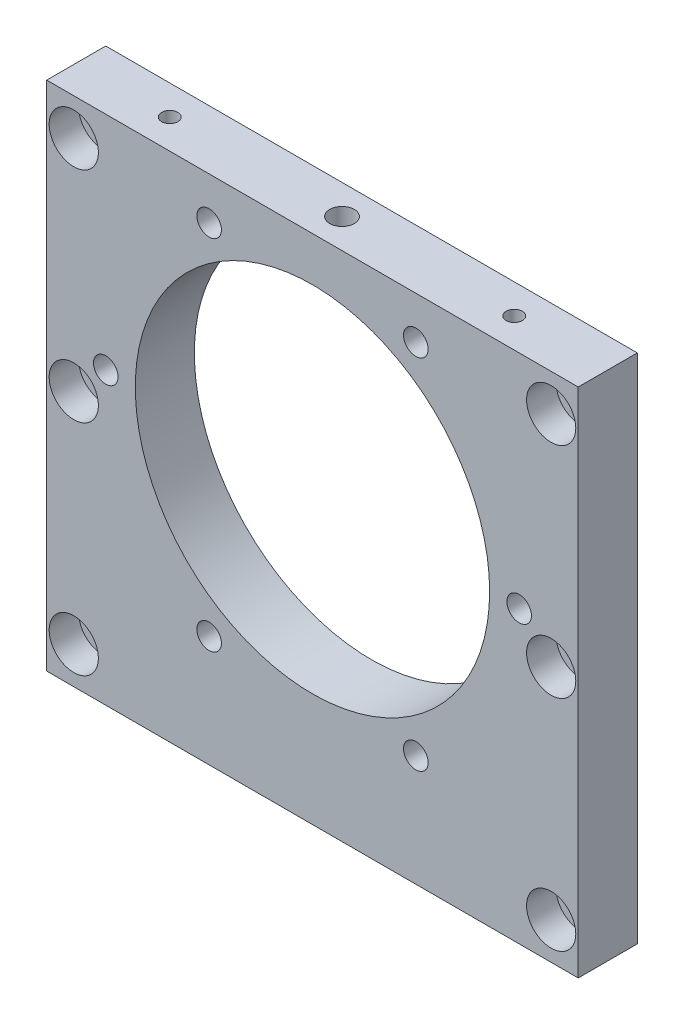
ISO-10303-21;
HEADER;
FILE_DESCRIPTION(('STEP AP214'),'2;1');
FILE_NAME('part.step','',(''),(''),'','','');
FILE_SCHEMA(('AUTOMOTIVE_DESIGN { 1 0 10303 214 1 1 1 1 }'));
ENDSEC;
DATA;
#1=APPLICATION_CONTEXT('core data for automotive mechanical design processes');
#2=APPLICATION_PROTOCOL_DEFINITION('international standard','automotive_design',2000,#1);
#3=PRODUCT_CONTEXT('',#1,'mechanical');
#4=PRODUCT('Part','Part','',(#3));
#5=PRODUCT_RELATED_PRODUCT_CATEGORY('part','',(#4));
#6=PRODUCT_DEFINITION_FORMATION('','',#4);
#7=PRODUCT_DEFINITION_CONTEXT('part definition',#1,'design');
#8=PRODUCT_DEFINITION('design','',#6,#7);
#9=PRODUCT_DEFINITION_SHAPE('','',#8);
#10=(LENGTH_UNIT() NAMED_UNIT(*) SI_UNIT(.MILLI.,.METRE.));
#11=(NAMED_UNIT(*) PLANE_ANGLE_UNIT() SI_UNIT($,.RADIAN.));
#12=(NAMED_UNIT(*) SI_UNIT($,.STERADIAN.) SOLID_ANGLE_UNIT());
#13=UNCERTAINTY_MEASURE_WITH_UNIT(LENGTH_MEASURE(1.E-05),#10,'distance_accuracy_value','');
#14=(GEOMETRIC_REPRESENTATION_CONTEXT(3) GLOBAL_UNCERTAINTY_ASSIGNED_CONTEXT((#13)) GLOBAL_UNIT_ASSIGNED_CONTEXT((#10,
#11,#12)) REPRESENTATION_CONTEXT('',''));
#15=CARTESIAN_POINT('',(0.,0.,0.));
#16=DIRECTION('',(0.,0.,1.));
#17=DIRECTION('',(1.,0.,0.));
#18=AXIS2_PLACEMENT_3D('',#15,#16,#17);
#19=CARTESIAN_POINT('',(48.5,44.5,6.));
#20=DIRECTION('',(0.,0.,-1.));
#21=DIRECTION('',(-1.,0.,0.));
#22=AXIS2_PLACEMENT_3D('',#19,#20,#21);
#23=CYLINDRICAL_SURFACE('',#22,3.25);
#24=CARTESIAN_POINT('',(48.5,44.5,-6.));
#25=DIRECTION('',(0.,0.,1.));
#26=DIRECTION('',(-1.,0.,0.));
#27=AXIS2_PLACEMENT_3D('',#24,#25,#26);
#28=CIRCLE('',#27,3.25);
#29=CARTESIAN_POINT('',(45.25,44.5,-6.));
#30=VERTEX_POINT('',#29);
#31=EDGE_CURVE('E200',#30,#30,#28,.T.);
#32=ORIENTED_EDGE('',*,*,#31,.F.);
#33=EDGE_LOOP('',(#32));
#34=FACE_BOUND('',#33,.T.);
#35=CARTESIAN_POINT('',(48.5,44.5,0.));
#36=DIRECTION('',(0.,0.,1.));
#37=DIRECTION('',(1.,0.,0.));
#38=AXIS2_PLACEMENT_3D('',#35,#36,#37);
#39=CIRCLE('',#38,3.25);
#40=CARTESIAN_POINT('',(51.75,44.5,0.));
#41=VERTEX_POINT('',#40);
#42=EDGE_CURVE('E125',#41,#41,#39,.T.);
#43=ORIENTED_EDGE('',*,*,#42,.T.);
#44=EDGE_LOOP('',(#43));
#45=FACE_BOUND('',#44,.T.);
#46=ADVANCED_FACE('F36',(#34,#45),#23,.F.);
#47=CARTESIAN_POINT('',(48.5,0.,6.));
#48=DIRECTION('',(0.,0.,-1.));
#49=DIRECTION('',(-1.,0.,0.));
#50=AXIS2_PLACEMENT_3D('',#47,#48,#49);
#51=CYLINDRICAL_SURFACE('',#50,3.25);
#52=CARTESIAN_POINT('',(48.5,0.,-6.));
#53=DIRECTION('',(0.,0.,1.));
#54=DIRECTION('',(-1.,0.,0.));
#55=AXIS2_PLACEMENT_3D('',#52,#53,#54);
#56=CIRCLE('',#55,3.25);
#57=CARTESIAN_POINT('',(45.25,0.,-6.));
#58=VERTEX_POINT('',#57);
#59=EDGE_CURVE('E203',#58,#58,#56,.T.);
#60=ORIENTED_EDGE('',*,*,#59,.F.);
#61=EDGE_LOOP('',(#60));
#62=FACE_BOUND('',#61,.T.);
#63=CARTESIAN_POINT('',(48.5,0.,0.));
#64=DIRECTION('',(0.,0.,1.));
#65=DIRECTION('',(1.,0.,0.));
#66=AXIS2_PLACEMENT_3D('',#63,#64,#65);
#67=CIRCLE('',#66,3.25);
#68=CARTESIAN_POINT('',(51.75,0.,0.));
#69=VERTEX_POINT('',#68);
#70=EDGE_CURVE('E132',#69,#69,#67,.T.);
#71=ORIENTED_EDGE('',*,*,#70,.T.);
#72=EDGE_LOOP('',(#71));
#73=FACE_BOUND('',#72,.T.);
#74=ADVANCED_FACE('F320',(#62,#73),#51,.F.);
#75=CARTESIAN_POINT('',(48.5,-44.5,6.));
#76=DIRECTION('',(0.,0.,-1.));
#77=DIRECTION('',(-1.,0.,0.));
#78=AXIS2_PLACEMENT_3D('',#75,#76,#77);
#79=CYLINDRICAL_SURFACE('',#78,3.25);
#80=CARTESIAN_POINT('',(48.5,-44.5,-6.));
#81=DIRECTION('',(0.,0.,1.));
#82=DIRECTION('',(-1.,0.,0.));
#83=AXIS2_PLACEMENT_3D('',#80,#81,#82);
#84=CIRCLE('',#83,3.25);
#85=CARTESIAN_POINT('',(45.25,-44.5,-6.));
#86=VERTEX_POINT('',#85);
#87=EDGE_CURVE('E206',#86,#86,#84,.T.);
#88=ORIENTED_EDGE('',*,*,#87,.F.);
#89=EDGE_LOOP('',(#88));
#90=FACE_BOUND('',#89,.T.);
#91=CARTESIAN_POINT('',(48.5,-44.5,0.));
#92=DIRECTION('',(0.,0.,1.));
#93=DIRECTION('',(1.,0.,0.));
#94=AXIS2_PLACEMENT_3D('',#91,#92,#93);
#95=CIRCLE('',#94,3.25);
#96=CARTESIAN_POINT('',(51.75,-44.5,0.));
#97=VERTEX_POINT('',#96);
#98=EDGE_CURVE('E139',#97,#97,#95,.T.);
#99=ORIENTED_EDGE('',*,*,#98,.T.);
#100=EDGE_LOOP('',(#99));
#101=FACE_BOUND('',#100,.T.);
#102=ADVANCED_FACE('F325',(#90,#101),#79,.F.);
#103=CARTESIAN_POINT('',(-48.5,-44.5,6.));
#104=DIRECTION('',(0.,0.,-1.));
#105=DIRECTION('',(-1.,0.,0.));
#106=AXIS2_PLACEMENT_3D('',#103,#104,#105);
#107=CYLINDRICAL_SURFACE('',#106,3.25);
#108=CARTESIAN_POINT('',(-48.5,-44.5,-6.));
#109=DIRECTION('',(0.,0.,1.));
#110=DIRECTION('',(1.,0.,0.));
#111=AXIS2_PLACEMENT_3D('',#108,#109,#110);
#112=CIRCLE('',#111,3.25);
#113=CARTESIAN_POINT('',(-45.25,-44.5,-6.));
#114=VERTEX_POINT('',#113);
#115=EDGE_CURVE('E209',#114,#114,#112,.T.);
#116=ORIENTED_EDGE('',*,*,#115,.F.);
#117=EDGE_LOOP('',(#116));
#118=FACE_BOUND('',#117,.T.);
#119=CARTESIAN_POINT('',(-48.5,-44.5,0.));
#120=DIRECTION('',(0.,0.,1.));
#121=DIRECTION('',(1.,0.,0.));
#122=AXIS2_PLACEMENT_3D('',#119,#120,#121);
#123=CIRCLE('',#122,3.25);
#124=CARTESIAN_POINT('',(-45.25,-44.5,0.));
#125=VERTEX_POINT('',#124);
#126=EDGE_CURVE('E146',#125,#125,#123,.T.);
#127=ORIENTED_EDGE('',*,*,#126,.T.);
#128=EDGE_LOOP('',(#127));
#129=FACE_BOUND('',#128,.T.);
#130=ADVANCED_FACE('F333',(#118,#129),#107,.F.);
#131=CARTESIAN_POINT('',(-48.5,0.,6.));
#132=DIRECTION('',(0.,0.,-1.));
#133=DIRECTION('',(-1.,0.,0.));
#134=AXIS2_PLACEMENT_3D('',#131,#132,#133);
#135=CYLINDRICAL_SURFACE('',#134,3.25);
#136=CARTESIAN_POINT('',(-48.5,0.,-6.));
#137=DIRECTION('',(0.,0.,1.));
#138=DIRECTION('',(1.,0.,0.));
#139=AXIS2_PLACEMENT_3D('',#136,#137,#138);
#140=CIRCLE('',#139,3.25);
#141=CARTESIAN_POINT('',(-45.25,0.,-6.));
#142=VERTEX_POINT('',#141);
#143=EDGE_CURVE('E212',#142,#142,#140,.T.);
#144=ORIENTED_EDGE('',*,*,#143,.F.);
#145=EDGE_LOOP('',(#144));
#146=FACE_BOUND('',#145,.T.);
#147=CARTESIAN_POINT('',(-48.5,0.,0.));
#148=DIRECTION('',(0.,0.,1.));
#149=DIRECTION('',(1.,0.,0.));
#150=AXIS2_PLACEMENT_3D('',#147,#148,#149);
#151=CIRCLE('',#150,3.25);
#152=CARTESIAN_POINT('',(-45.25,0.,0.));
#153=VERTEX_POINT('',#152);
#154=EDGE_CURVE('E153',#153,#153,#151,.T.);
#155=ORIENTED_EDGE('',*,*,#154,.T.);
#156=EDGE_LOOP('',(#155));
#157=FACE_BOUND('',#156,.T.);
#158=ADVANCED_FACE('F337',(#146,#157),#135,.F.);
#159=CARTESIAN_POINT('',(-48.5,44.5,6.));
#160=DIRECTION('',(0.,0.,-1.));
#161=DIRECTION('',(-1.,0.,0.));
#162=AXIS2_PLACEMENT_3D('',#159,#160,#161);
#163=CYLINDRICAL_SURFACE('',#162,3.25);
#164=CARTESIAN_POINT('',(-48.5,44.5,-6.));
#165=DIRECTION('',(0.,0.,1.));
#166=DIRECTION('',(1.,0.,0.));
#167=AXIS2_PLACEMENT_3D('',#164,#165,#166);
#168=CIRCLE('',#167,3.25);
#169=CARTESIAN_POINT('',(-45.25,44.5,-6.));
#170=VERTEX_POINT('',#169);
#171=EDGE_CURVE('E215',#170,#170,#168,.T.);
#172=ORIENTED_EDGE('',*,*,#171,.F.);
#173=EDGE_LOOP('',(#172));
#174=FACE_BOUND('',#173,.T.);
#175=CARTESIAN_POINT('',(-48.5,44.5,0.));
#176=DIRECTION('',(0.,0.,1.));
#177=DIRECTION('',(1.,0.,0.));
#178=AXIS2_PLACEMENT_3D('',#175,#176,#177);
#179=CIRCLE('',#178,3.25);
#180=CARTESIAN_POINT('',(-45.25,44.5,0.));
#181=VERTEX_POINT('',#180);
#182=EDGE_CURVE('E160',#181,#181,#179,.T.);
#183=ORIENTED_EDGE('',*,*,#182,.T.);
#184=EDGE_LOOP('',(#183));
#185=FACE_BOUND('',#184,.T.);
#186=ADVANCED_FACE('F273',(#174,#185),#163,.F.);
#187=CARTESIAN_POINT('',(-54.,52.,6.));
#188=DIRECTION('',(0.,0.,1.));
#189=DIRECTION('',(1.,0.,0.));
#190=AXIS2_PLACEMENT_3D('',#187,#188,#189);
#191=PLANE('',#190);
#192=CARTESIAN_POINT('',(48.5,44.5,6.));
#193=DIRECTION('',(0.,0.,1.));
#194=DIRECTION('',(1.,0.,0.));
#195=AXIS2_PLACEMENT_3D('',#192,#193,#194);
#196=CIRCLE('',#195,5.);
#197=CARTESIAN_POINT('',(53.5,44.5,6.));
#198=VERTEX_POINT('',#197);
#199=EDGE_CURVE('E126',#198,#198,#196,.T.);
#200=ORIENTED_EDGE('',*,*,#199,.F.);
#201=EDGE_LOOP('',(#200));
#202=FACE_BOUND('',#201,.T.);
#203=CARTESIAN_POINT('',(48.5,0.,6.));
#204=DIRECTION('',(0.,0.,1.));
#205=DIRECTION('',(1.,0.,0.));
#206=AXIS2_PLACEMENT_3D('',#203,#204,#205);
#207=CIRCLE('',#206,5.);
#208=CARTESIAN_POINT('',(53.5,0.,6.));
#209=VERTEX_POINT('',#208);
#210=EDGE_CURVE('E133',#209,#209,#207,.T.);
#211=ORIENTED_EDGE('',*,*,#210,.F.);
#212=EDGE_LOOP('',(#211));
#213=FACE_BOUND('',#212,.T.);
#214=CARTESIAN_POINT('',(48.5,-44.5,6.));
#215=DIRECTION('',(0.,0.,1.));
#216=DIRECTION('',(1.,0.,0.));
#217=AXIS2_PLACEMENT_3D('',#214,#215,#216);
#218=CIRCLE('',#217,5.);
#219=CARTESIAN_POINT('',(53.5,-44.5,6.));
#220=VERTEX_POINT('',#219);
#221=EDGE_CURVE('E140',#220,#220,#218,.T.);
#222=ORIENTED_EDGE('',*,*,#221,.F.);
#223=EDGE_LOOP('',(#222));
#224=FACE_BOUND('',#223,.T.);
#225=CARTESIAN_POINT('',(-48.5,-44.5,6.));
#226=DIRECTION('',(0.,0.,1.));
#227=DIRECTION('',(1.,0.,0.));
#228=AXIS2_PLACEMENT_3D('',#225,#226,#227);
#229=CIRCLE('',#228,5.);
#230=CARTESIAN_POINT('',(-43.5,-44.5,6.));
#231=VERTEX_POINT('',#230);
#232=EDGE_CURVE('E147',#231,#231,#229,.T.);
#233=ORIENTED_EDGE('',*,*,#232,.F.);
#234=EDGE_LOOP('',(#233));
#235=FACE_BOUND('',#234,.T.);
#236=CARTESIAN_POINT('',(-48.5,0.,6.));
#237=DIRECTION('',(0.,0.,1.));
#238=DIRECTION('',(1.,0.,0.));
#239=AXIS2_PLACEMENT_3D('',#236,#237,#238);
#240=CIRCLE('',#239,5.);
#241=CARTESIAN_POINT('',(-43.5,0.,6.));
#242=VERTEX_POINT('',#241);
#243=EDGE_CURVE('E154',#242,#242,#240,.T.);
#244=ORIENTED_EDGE('',*,*,#243,.F.);
#245=EDGE_LOOP('',(#244));
#246=FACE_BOUND('',#245,.T.);
#247=CARTESIAN_POINT('',(-48.5,44.5,6.));
#248=DIRECTION('',(0.,0.,1.));
#249=DIRECTION('',(1.,0.,0.));
#250=AXIS2_PLACEMENT_3D('',#247,#248,#249);
#251=CIRCLE('',#250,5.);
#252=CARTESIAN_POINT('',(-43.5,44.5,6.));
#253=VERTEX_POINT('',#252);
#254=EDGE_CURVE('E161',#253,#253,#251,.T.);
#255=ORIENTED_EDGE('',*,*,#254,.F.);
#256=EDGE_LOOP('',(#255));
#257=FACE_BOUND('',#256,.T.);
#258=CARTESIAN_POINT('',(-20.9999999999999,43.3730669589465,6.));
#259=DIRECTION('',(0.,0.,1.));
#260=DIRECTION('',(1.,0.,0.));
#261=AXIS2_PLACEMENT_3D('',#258,#259,#260);
#262=CIRCLE('',#261,2.49999999999999);
#263=CARTESIAN_POINT('',(-18.4999999999999,43.3730669589465,6.));
#264=VERTEX_POINT('',#263);
#265=EDGE_CURVE('E164',#264,#264,#262,.T.);
#266=ORIENTED_EDGE('',*,*,#265,.F.);
#267=EDGE_LOOP('',(#266));
#268=FACE_BOUND('',#267,.T.);
#269=CARTESIAN_POINT('',(-42.,7.,6.));
#270=DIRECTION('',(0.,0.,1.));
#271=DIRECTION('',(1.,0.,0.));
#272=AXIS2_PLACEMENT_3D('',#269,#270,#271);
#273=CIRCLE('',#272,2.49999999999999);
#274=CARTESIAN_POINT('',(-39.5,7.,6.));
#275=VERTEX_POINT('',#274);
#276=EDGE_CURVE('E170',#275,#275,#273,.T.);
#277=ORIENTED_EDGE('',*,*,#276,.F.);
#278=EDGE_LOOP('',(#277));
#279=FACE_BOUND('',#278,.T.);
#280=CARTESIAN_POINT('',(-20.9999999999999,-29.3730669589465,6.));
#281=DIRECTION('',(0.,0.,1.));
#282=DIRECTION('',(1.,0.,0.));
#283=AXIS2_PLACEMENT_3D('',#280,#281,#282);
#284=CIRCLE('',#283,2.49999999999999);
#285=CARTESIAN_POINT('',(-18.4999999999999,-29.3730669589465,6.));
#286=VERTEX_POINT('',#285);
#287=EDGE_CURVE('E176',#286,#286,#284,.T.);
#288=ORIENTED_EDGE('',*,*,#287,.F.);
#289=EDGE_LOOP('',(#288));
#290=FACE_BOUND('',#289,.T.);
#291=CARTESIAN_POINT('',(20.9999999999999,-29.3730669589465,6.));
#292=DIRECTION('',(0.,0.,1.));
#293=DIRECTION('',(1.,0.,0.));
#294=AXIS2_PLACEMENT_3D('',#291,#292,#293);
#295=CIRCLE('',#294,2.49999999999999);
#296=CARTESIAN_POINT('',(23.4999999999999,-29.3730669589465,6.));
#297=VERTEX_POINT('',#296);
#298=EDGE_CURVE('E182',#297,#297,#295,.T.);
#299=ORIENTED_EDGE('',*,*,#298,.F.);
#300=EDGE_LOOP('',(#299));
#301=FACE_BOUND('',#300,.T.);
#302=CARTESIAN_POINT('',(42.,7.00000000000001,6.));
#303=DIRECTION('',(0.,0.,1.));
#304=DIRECTION('',(1.,0.,0.));
#305=AXIS2_PLACEMENT_3D('',#302,#303,#304);
#306=CIRCLE('',#305,2.49999999999999);
#307=CARTESIAN_POINT('',(44.5,7.00000000000001,6.));
#308=VERTEX_POINT('',#307);
#309=EDGE_CURVE('E188',#308,#308,#306,.T.);
#310=ORIENTED_EDGE('',*,*,#309,.F.);
#311=EDGE_LOOP('',(#310));
#312=FACE_BOUND('',#311,.T.);
#313=CARTESIAN_POINT('',(20.9999999999999,43.3730669589465,6.));
#314=DIRECTION('',(0.,0.,1.));
#315=DIRECTION('',(1.,0.,0.));
#316=AXIS2_PLACEMENT_3D('',#313,#314,#315);
#317=CIRCLE('',#316,2.49999999999999);
#318=CARTESIAN_POINT('',(23.4999999999999,43.3730669589465,6.));
#319=VERTEX_POINT('',#318);
#320=EDGE_CURVE('E194',#319,#319,#317,.T.);
#321=ORIENTED_EDGE('',*,*,#320,.F.);
#322=EDGE_LOOP('',(#321));
#323=FACE_BOUND('',#322,.T.);
#324=DIRECTION('',(0.,-1.,0.));
#325=VECTOR('',#324,1.);
#326=CARTESIAN_POINT('',(-54.,-52.,6.));
#327=LINE('',#326,#325);
#328=CARTESIAN_POINT('',(-54.,52.,6.));
#329=VERTEX_POINT('',#328);
#330=CARTESIAN_POINT('',(-54.,-52.,6.));
#331=VERTEX_POINT('',#330);
#332=EDGE_CURVE('E225',#329,#331,#327,.T.);
#333=ORIENTED_EDGE('',*,*,#332,.T.);
#334=DIRECTION('',(1.,0.,0.));
#335=VECTOR('',#334,1.);
#336=CARTESIAN_POINT('',(54.,-52.,6.));
#337=LINE('',#336,#335);
#338=CARTESIAN_POINT('',(54.,-52.,6.));
#339=VERTEX_POINT('',#338);
#340=EDGE_CURVE('E91',#331,#339,#337,.T.);
#341=ORIENTED_EDGE('',*,*,#340,.T.);
#342=DIRECTION('',(0.,1.,0.));
#343=VECTOR('',#342,1.);
#344=CARTESIAN_POINT('',(54.,-52.,6.));
#345=LINE('',#344,#343);
#346=CARTESIAN_POINT('',(54.,52.,6.));
#347=VERTEX_POINT('',#346);
#348=EDGE_CURVE('E228',#339,#347,#345,.T.);
#349=ORIENTED_EDGE('',*,*,#348,.T.);
#350=DIRECTION('',(-1.,0.,0.));
#351=VECTOR('',#350,1.);
#352=CARTESIAN_POINT('',(54.,52.,6.));
#353=LINE('',#352,#351);
#354=EDGE_CURVE('E60',#347,#329,#353,.T.);
#355=ORIENTED_EDGE('',*,*,#354,.T.);
#356=EDGE_LOOP('',(#333,#341,#349,#355));
#357=FACE_BOUND('',#356,.T.);
#358=CARTESIAN_POINT('',(0.,7.00000000000001,6.));
#359=DIRECTION('',(0.,0.,1.));
#360=DIRECTION('',(1.,0.,0.));
#361=AXIS2_PLACEMENT_3D('',#358,#359,#360);
#362=CIRCLE('',#361,36.);
#363=CARTESIAN_POINT('',(36.,7.00000000000001,6.));
#364=VERTEX_POINT('',#363);
#365=EDGE_CURVE('E219',#364,#364,#362,.T.);
#366=ORIENTED_EDGE('',*,*,#365,.F.);
#367=EDGE_LOOP('',(#366));
#368=FACE_BOUND('',#367,.T.);
#369=ADVANCED_FACE('F269',(#202,#213,#224,#235,#246,#257,#268,#279,#290,#301,#312,#323,#357,
#368),#191,.T.);
#370=CARTESIAN_POINT('',(-54.,52.,-6.));
#371=DIRECTION('',(0.,0.,1.));
#372=DIRECTION('',(1.,0.,0.));
#373=AXIS2_PLACEMENT_3D('',#370,#371,#372);
#374=PLANE('',#373);
#375=CARTESIAN_POINT('',(-20.9999999999999,43.3730669589465,-6.));
#376=DIRECTION('',(0.,0.,1.));
#377=DIRECTION('',(1.,0.,0.));
#378=AXIS2_PLACEMENT_3D('',#375,#376,#377);
#379=CIRCLE('',#378,2.5);
#380=CARTESIAN_POINT('',(-18.4999999999999,43.3730669589465,-6.));
#381=VERTEX_POINT('',#380);
#382=EDGE_CURVE('E167',#381,#381,#379,.T.);
#383=ORIENTED_EDGE('',*,*,#382,.T.);
#384=EDGE_LOOP('',(#383));
#385=FACE_BOUND('',#384,.T.);
#386=CARTESIAN_POINT('',(-42.,7.,-6.));
#387=DIRECTION('',(0.,0.,1.));
#388=DIRECTION('',(1.,0.,0.));
#389=AXIS2_PLACEMENT_3D('',#386,#387,#388);
#390=CIRCLE('',#389,2.5);
#391=CARTESIAN_POINT('',(-39.5,7.,-6.));
#392=VERTEX_POINT('',#391);
#393=EDGE_CURVE('E173',#392,#392,#390,.T.);
#394=ORIENTED_EDGE('',*,*,#393,.T.);
#395=EDGE_LOOP('',(#394));
#396=FACE_BOUND('',#395,.T.);
#397=CARTESIAN_POINT('',(-20.9999999999999,-29.3730669589465,-6.));
#398=DIRECTION('',(0.,0.,1.));
#399=DIRECTION('',(1.,0.,0.));
#400=AXIS2_PLACEMENT_3D('',#397,#398,#399);
#401=CIRCLE('',#400,2.5);
#402=CARTESIAN_POINT('',(-18.4999999999999,-29.3730669589465,-6.));
#403=VERTEX_POINT('',#402);
#404=EDGE_CURVE('E179',#403,#403,#401,.T.);
#405=ORIENTED_EDGE('',*,*,#404,.T.);
#406=EDGE_LOOP('',(#405));
#407=FACE_BOUND('',#406,.T.);
#408=CARTESIAN_POINT('',(20.9999999999999,-29.3730669589465,-6.));
#409=DIRECTION('',(0.,0.,1.));
#410=DIRECTION('',(1.,0.,0.));
#411=AXIS2_PLACEMENT_3D('',#408,#409,#410);
#412=CIRCLE('',#411,2.5);
#413=CARTESIAN_POINT('',(23.4999999999999,-29.3730669589465,-6.));
#414=VERTEX_POINT('',#413);
#415=EDGE_CURVE('E185',#414,#414,#412,.T.);
#416=ORIENTED_EDGE('',*,*,#415,.T.);
#417=EDGE_LOOP('',(#416));
#418=FACE_BOUND('',#417,.T.);
#419=CARTESIAN_POINT('',(42.,7.00000000000001,-6.));
#420=DIRECTION('',(0.,0.,1.));
#421=DIRECTION('',(1.,0.,0.));
#422=AXIS2_PLACEMENT_3D('',#419,#420,#421);
#423=CIRCLE('',#422,2.5);
#424=CARTESIAN_POINT('',(44.5,7.00000000000001,-6.));
#425=VERTEX_POINT('',#424);
#426=EDGE_CURVE('E191',#425,#425,#423,.T.);
#427=ORIENTED_EDGE('',*,*,#426,.T.);
#428=EDGE_LOOP('',(#427));
#429=FACE_BOUND('',#428,.T.);
#430=CARTESIAN_POINT('',(20.9999999999999,43.3730669589465,-6.));
#431=DIRECTION('',(0.,0.,1.));
#432=DIRECTION('',(1.,0.,0.));
#433=AXIS2_PLACEMENT_3D('',#430,#431,#432);
#434=CIRCLE('',#433,2.5);
#435=CARTESIAN_POINT('',(23.4999999999999,43.3730669589465,-6.));
#436=VERTEX_POINT('',#435);
#437=EDGE_CURVE('E197',#436,#436,#434,.T.);
#438=ORIENTED_EDGE('',*,*,#437,.T.);
#439=EDGE_LOOP('',(#438));
#440=FACE_BOUND('',#439,.T.);
#441=ORIENTED_EDGE('',*,*,#59,.T.);
#442=EDGE_LOOP('',(#441));
#443=FACE_BOUND('',#442,.T.);
#444=ORIENTED_EDGE('',*,*,#115,.T.);
#445=EDGE_LOOP('',(#444));
#446=FACE_BOUND('',#445,.T.);
#447=ORIENTED_EDGE('',*,*,#171,.T.);
#448=EDGE_LOOP('',(#447));
#449=FACE_BOUND('',#448,.T.);
#450=DIRECTION('',(0.,-1.,0.));
#451=VECTOR('',#450,1.);
#452=CARTESIAN_POINT('',(-54.,-52.,-6.));
#453=LINE('',#452,#451);
#454=CARTESIAN_POINT('',(-54.,52.,-6.));
#455=VERTEX_POINT('',#454);
#456=CARTESIAN_POINT('',(-54.,-52.,-6.));
#457=VERTEX_POINT('',#456);
#458=EDGE_CURVE('E222',#455,#457,#453,.T.);
#459=ORIENTED_EDGE('',*,*,#458,.F.);
#460=DIRECTION('',(-1.,0.,0.));
#461=VECTOR('',#460,1.);
#462=CARTESIAN_POINT('',(54.,52.,-6.));
#463=LINE('',#462,#461);
#464=CARTESIAN_POINT('',(54.,52.,-6.));
#465=VERTEX_POINT('',#464);
#466=EDGE_CURVE('E84',#465,#455,#463,.T.);
#467=ORIENTED_EDGE('',*,*,#466,.F.);
#468=DIRECTION('',(0.,1.,0.));
#469=VECTOR('',#468,1.);
#470=CARTESIAN_POINT('',(54.,-52.,-6.));
#471=LINE('',#470,#469);
#472=CARTESIAN_POINT('',(54.,-52.,-6.));
#473=VERTEX_POINT('',#472);
#474=EDGE_CURVE('E78',#473,#465,#471,.T.);
#475=ORIENTED_EDGE('',*,*,#474,.F.);
#476=DIRECTION('',(1.,0.,0.));
#477=VECTOR('',#476,1.);
#478=CARTESIAN_POINT('',(54.,-52.,-6.));
#479=LINE('',#478,#477);
#480=EDGE_CURVE('E234',#457,#473,#479,.T.);
#481=ORIENTED_EDGE('',*,*,#480,.F.);
#482=EDGE_LOOP('',(#459,#467,#475,#481));
#483=FACE_BOUND('',#482,.T.);
#484=CARTESIAN_POINT('',(0.,7.00000000000001,-6.));
#485=DIRECTION('',(0.,0.,1.));
#486=DIRECTION('',(1.,0.,0.));
#487=AXIS2_PLACEMENT_3D('',#484,#485,#486);
#488=CIRCLE('',#487,36.);
#489=CARTESIAN_POINT('',(36.,7.00000000000001,-6.));
#490=VERTEX_POINT('',#489);
#491=EDGE_CURVE('E218',#490,#490,#488,.T.);
#492=ORIENTED_EDGE('',*,*,#491,.T.);
#493=EDGE_LOOP('',(#492));
#494=FACE_BOUND('',#493,.T.);
#495=ORIENTED_EDGE('',*,*,#143,.T.);
#496=EDGE_LOOP('',(#495));
#497=FACE_BOUND('',#496,.T.);
#498=ORIENTED_EDGE('',*,*,#87,.T.);
#499=EDGE_LOOP('',(#498));
#500=FACE_BOUND('',#499,.T.);
#501=ORIENTED_EDGE('',*,*,#31,.T.);
#502=EDGE_LOOP('',(#501));
#503=FACE_BOUND('',#502,.T.);
#504=ADVANCED_FACE('F272',(#385,#396,#407,#418,#429,#440,#443,#446,#449,#483,#494,#497,#500,
#503),#374,.F.);
#505=CARTESIAN_POINT('',(-54.,-52.,6.));
#506=DIRECTION('',(1.,0.,0.));
#507=DIRECTION('',(0.,0.,-1.));
#508=AXIS2_PLACEMENT_3D('',#505,#506,#507);
#509=PLANE('',#508);
#510=ORIENTED_EDGE('',*,*,#458,.T.);
#511=DIRECTION('',(0.,0.,-1.));
#512=VECTOR('',#511,1.);
#513=CARTESIAN_POINT('',(-54.,-52.,6.));
#514=LINE('',#513,#512);
#515=EDGE_CURVE('E11',#331,#457,#514,.T.);
#516=ORIENTED_EDGE('',*,*,#515,.F.);
#517=ORIENTED_EDGE('',*,*,#332,.F.);
#518=DIRECTION('',(0.,0.,-1.));
#519=VECTOR('',#518,1.);
#520=CARTESIAN_POINT('',(-54.,52.,6.));
#521=LINE('',#520,#519);
#522=EDGE_CURVE('E231',#329,#455,#521,.T.);
#523=ORIENTED_EDGE('',*,*,#522,.T.);
#524=EDGE_LOOP('',(#510,#516,#517,#523));
#525=FACE_BOUND('',#524,.T.);
#526=ADVANCED_FACE('F38',(#525),#509,.F.);
#527=CARTESIAN_POINT('',(54.,-52.,6.));
#528=DIRECTION('',(0.,1.,0.));
#529=DIRECTION('',(-1.,0.,0.));
#530=AXIS2_PLACEMENT_3D('',#527,#528,#529);
#531=PLANE('',#530);
#532=ORIENTED_EDGE('',*,*,#480,.T.);
#533=DIRECTION('',(0.,0.,-1.));
#534=VECTOR('',#533,1.);
#535=CARTESIAN_POINT('',(54.,-52.,6.));
#536=LINE('',#535,#534);
#537=EDGE_CURVE('E51',#339,#473,#536,.T.);
#538=ORIENTED_EDGE('',*,*,#537,.F.);
#539=ORIENTED_EDGE('',*,*,#340,.F.);
#540=ORIENTED_EDGE('',*,*,#515,.T.);
#541=EDGE_LOOP('',(#532,#538,#539,#540));
#542=FACE_BOUND('',#541,.T.);
#543=ADVANCED_FACE('F351',(#542),#531,.F.);
#544=CARTESIAN_POINT('',(54.,-52.,6.));
#545=DIRECTION('',(-1.,0.,0.));
#546=DIRECTION('',(0.,0.,1.));
#547=AXIS2_PLACEMENT_3D('',#544,#545,#546);
#548=PLANE('',#547);
#549=ORIENTED_EDGE('',*,*,#474,.T.);
#550=DIRECTION('',(0.,0.,-1.));
#551=VECTOR('',#550,1.);
#552=CARTESIAN_POINT('',(54.,52.,6.));
#553=LINE('',#552,#551);
#554=EDGE_CURVE('E239',#347,#465,#553,.T.);
#555=ORIENTED_EDGE('',*,*,#554,.F.);
#556=ORIENTED_EDGE('',*,*,#348,.F.);
#557=ORIENTED_EDGE('',*,*,#537,.T.);
#558=EDGE_LOOP('',(#549,#555,#556,#557));
#559=FACE_BOUND('',#558,.T.);
#560=ADVANCED_FACE('F348',(#559),#548,.F.);
#561=CARTESIAN_POINT('',(54.,52.,6.));
#562=DIRECTION('',(0.,-1.,0.));
#563=DIRECTION('',(1.,0.,0.));
#564=AXIS2_PLACEMENT_3D('',#561,#562,#563);
#565=PLANE('',#564);
#566=CARTESIAN_POINT('',(-35.,52.,0.));
#567=DIRECTION('',(0.,1.,0.));
#568=DIRECTION('',(0.,0.,1.));
#569=AXIS2_PLACEMENT_3D('',#566,#567,#568);
#570=CIRCLE('',#569,1.65);
#571=CARTESIAN_POINT('',(-35.,52.,1.65));
#572=VERTEX_POINT('',#571);
#573=EDGE_CURVE('E109',#572,#572,#570,.T.);
#574=ORIENTED_EDGE('',*,*,#573,.F.);
#575=EDGE_LOOP('',(#574));
#576=FACE_BOUND('',#575,.T.);
#577=CARTESIAN_POINT('',(35.,52.,0.));
#578=DIRECTION('',(0.,1.,0.));
#579=DIRECTION('',(0.,0.,1.));
#580=AXIS2_PLACEMENT_3D('',#577,#578,#579);
#581=CIRCLE('',#580,1.65);
#582=CARTESIAN_POINT('',(35.,52.,1.65));
#583=VERTEX_POINT('',#582);
#584=EDGE_CURVE('E108',#583,#583,#581,.T.);
#585=ORIENTED_EDGE('',*,*,#584,.F.);
#586=EDGE_LOOP('',(#585));
#587=FACE_BOUND('',#586,.T.);
#588=CARTESIAN_POINT('',(0.,52.,0.));
#589=DIRECTION('',(0.,1.,0.));
#590=DIRECTION('',(0.,0.,1.));
#591=AXIS2_PLACEMENT_3D('',#588,#589,#590);
#592=CIRCLE('',#591,2.49999999999999);
#593=CARTESIAN_POINT('',(0.,52.,2.49999999999999));
#594=VERTEX_POINT('',#593);
#595=EDGE_CURVE('E119',#594,#594,#592,.T.);
#596=ORIENTED_EDGE('',*,*,#595,.F.);
#597=EDGE_LOOP('',(#596));
#598=FACE_BOUND('',#597,.T.);
#599=ORIENTED_EDGE('',*,*,#466,.T.);
#600=ORIENTED_EDGE('',*,*,#522,.F.);
#601=ORIENTED_EDGE('',*,*,#354,.F.);
#602=ORIENTED_EDGE('',*,*,#554,.T.);
#603=EDGE_LOOP('',(#599,#600,#601,#602));
#604=FACE_BOUND('',#603,.T.);
#605=ADVANCED_FACE('F305',(#576,#587,#598,#604),#565,.F.);
#606=CARTESIAN_POINT('',(0.,7.00000000000001,6.));
#607=DIRECTION('',(0.,0.,-1.));
#608=DIRECTION('',(-1.,0.,0.));
#609=AXIS2_PLACEMENT_3D('',#606,#607,#608);
#610=CYLINDRICAL_SURFACE('',#609,36.);
#611=CARTESIAN_POINT('',(0.,43.,2.49999999999999));
#612=CARTESIAN_POINT('',(-0.140244786781292,42.9999988509644,2.4999938421609));
#613=CARTESIAN_POINT('',(-0.280586950825113,42.9991717190085,2.48815917208363));
#614=CARTESIAN_POINT('',(-0.557393754546177,42.9959516468592,2.4411195187425));
#615=CARTESIAN_POINT('',(-0.693853727423131,42.9935568988739,2.40588755277863));
#616=CARTESIAN_POINT('',(-0.958846682815945,42.9874724168845,2.31307222334385));
#617=CARTESIAN_POINT('',(-1.08738389555148,42.9837833811095,2.25550090950095));
#618=CARTESIAN_POINT('',(-1.33293751710899,42.975524871889,2.11966128849868));
#619=CARTESIAN_POINT('',(-1.44995650364141,42.9709555961159,2.0413976266814));
#620=CARTESIAN_POINT('',(-1.66939709631614,42.9614406743989,1.8662401719676));
#621=CARTESIAN_POINT('',(-1.77179498368708,42.9564944364284,1.76931669339656));
#622=CARTESIAN_POINT('',(-1.95888357785358,42.9467880859668,1.55965273730293));
#623=CARTESIAN_POINT('',(-2.04357353358036,42.9420279813775,1.44691158922438));
#624=CARTESIAN_POINT('',(-2.19291819196183,42.933226021013,1.20867457547407));
#625=CARTESIAN_POINT('',(-2.25755273848221,42.9291848895503,1.08316604538357));
#626=CARTESIAN_POINT('',(-2.36482296564199,42.9222844264846,0.823045603394416));
#627=CARTESIAN_POINT('',(-2.40745892848642,42.9194250797213,0.688433808300484));
#628=CARTESIAN_POINT('',(-2.46945468930764,42.9152163792123,0.414160231722021));
#629=CARTESIAN_POINT('',(-2.48885225274188,42.9138645757581,0.274507024797708));
#630=CARTESIAN_POINT('',(-2.50393719941633,42.9128160764956,-0.00607921992222424));
#631=CARTESIAN_POINT('',(-2.4996249043248,42.9131193582329,-0.147012240328901));
#632=CARTESIAN_POINT('',(-2.46744383757692,42.9153445550043,-0.425899769597206));
#633=CARTESIAN_POINT('',(-2.43961598450383,42.9172636583838,-0.563859025644632));
#634=CARTESIAN_POINT('',(-2.3612572323993,42.9224998182836,-0.833143606861028));
#635=CARTESIAN_POINT('',(-2.31072617135811,42.9258168847797,-0.964468884682592));
#636=CARTESIAN_POINT('',(-2.18834913361685,42.9334784177087,-1.2168888153336));
#637=CARTESIAN_POINT('',(-2.11648465645685,42.9378237752152,-1.33797447071574));
#638=CARTESIAN_POINT('',(-1.95349413693172,42.9470513560612,-1.566379609176));
#639=CARTESIAN_POINT('',(-1.86236782559428,42.9519335868973,-1.67369889998693));
#640=CARTESIAN_POINT('',(-1.6632102090069,42.9616972452725,-1.87176293293811));
#641=CARTESIAN_POINT('',(-1.55514350293498,42.9665786492027,-1.96247208377831));
#642=CARTESIAN_POINT('',(-1.32529663413865,42.9757806714793,-2.12446620994909));
#643=CARTESIAN_POINT('',(-1.20351646549348,42.9801012895837,-2.19575117689327));
#644=CARTESIAN_POINT('',(-0.949677506655536,42.9876953677817,-2.31687064620875));
#645=CARTESIAN_POINT('',(-0.817618038187155,42.9909687587016,-2.36670373166675));
#646=CARTESIAN_POINT('',(-0.546979096917852,42.9960986538663,-2.44348074077107));
#647=CARTESIAN_POINT('',(-0.4083997181206,42.9979551785329,-2.47042499432051));
#648=CARTESIAN_POINT('',(-0.128963424368524,43.0000395224048,-2.50061523262924));
#649=CARTESIAN_POINT('',(0.0118881515675209,43.0002707225313,-2.50391041134481));
#650=CARTESIAN_POINT('',(0.292141938000203,42.999087369779,-2.48683759918826));
#651=CARTESIAN_POINT('',(0.431544157830588,42.9976728275053,-2.46646976079963));
#652=CARTESIAN_POINT('',(0.704803025359321,42.9933593575884,-2.402689827602));
#653=CARTESIAN_POINT('',(0.838664982371952,42.9904618884092,-2.35930037309859));
#654=CARTESIAN_POINT('',(1.09720752745678,42.983508389952,-2.25073190723325));
#655=CARTESIAN_POINT('',(1.22188801382099,42.9794523478423,-2.18555265453854));
#656=CARTESIAN_POINT('',(1.45875325290176,42.9706286980218,-2.03513004523839));
#657=CARTESIAN_POINT('',(1.57091714748786,42.9658599326408,-1.94985391299147));
#658=CARTESIAN_POINT('',(1.77935513468024,42.9561511324582,-1.76170581781532));
#659=CARTESIAN_POINT('',(1.87562903499629,42.9512110955848,-1.65883364198106));
#660=CARTESIAN_POINT('',(2.04972145225366,42.9417066616871,-1.43820100567623));
#661=CARTESIAN_POINT('',(2.12750799759052,42.9371429241977,-1.32041528538457));
#662=CARTESIAN_POINT('',(2.26219878275195,42.9289163416701,-1.0734256413733));
#663=CARTESIAN_POINT('',(2.31910317570609,42.9252534900257,-0.944221801391793));
#664=CARTESIAN_POINT('',(2.41035925445419,42.9192465437059,-0.678179239553595));
#665=CARTESIAN_POINT('',(2.4447308962179,42.9169012823801,-0.541347390260964));
#666=CARTESIAN_POINT('',(2.49001090310151,42.9137907886791,-0.263837913917287));
#667=CARTESIAN_POINT('',(2.50091956640461,42.913025536224,-0.123160335763342));
#668=CARTESIAN_POINT('',(2.49896093843368,42.9131618534813,0.157729457876203));
#669=CARTESIAN_POINT('',(2.48614389965456,42.9140599002259,0.297942028238534));
#670=CARTESIAN_POINT('',(2.43720206768164,42.9174141519862,0.574218786012314));
#671=CARTESIAN_POINT('',(2.40107723399478,42.9198703597088,0.710282966216258));
#672=CARTESIAN_POINT('',(2.3065570555549,42.9260632718926,0.974406736917468));
#673=CARTESIAN_POINT('',(2.24816215207807,42.9297999509814,1.10246648596214));
#674=CARTESIAN_POINT('',(2.11076581719233,42.9381327241118,1.34697160444051));
#675=CARTESIAN_POINT('',(2.03176485575469,42.9427287985522,1.46341723867863));
#676=CARTESIAN_POINT('',(1.85521162805174,42.9522739050972,1.68164458838591));
#677=CARTESIAN_POINT('',(1.75762263915935,42.957223623559,1.78339656331547));
#678=CARTESIAN_POINT('',(1.54672043303064,42.9669122200506,1.96911151275512));
#679=CARTESIAN_POINT('',(1.43340338764935,42.9716510463782,2.05307014382809));
#680=CARTESIAN_POINT('',(1.19410614941701,42.9803898811301,2.20089197353774));
#681=CARTESIAN_POINT('',(1.06810817365864,42.9843888290653,2.26472641838007));
#682=CARTESIAN_POINT('',(0.807244898908944,42.9911837704046,2.37025480378413));
#683=CARTESIAN_POINT('',(0.67239013418317,42.9939811641002,2.41197453019436));
#684=CARTESIAN_POINT('',(0.44726584163566,42.9973292186699,2.46131146533396));
#685=CARTESIAN_POINT('',(0.358449399549282,42.9983262780721,2.47580074889351));
#686=CARTESIAN_POINT('',(0.179768642778903,42.9996620364582,2.49514698156115));
#687=CARTESIAN_POINT('',(0.0899043299262239,43.0000007365926,2.50000394750072));
#688=CARTESIAN_POINT('',(0.,43.,2.49999999999999));
#689=B_SPLINE_CURVE_WITH_KNOTS('',3,(#611,#612,#613,#614,#615,#616,#617,#618,#619,#620,#621,
#622,#623,#624,#625,#626,#627,#628,#629,#630,#631,#632,#633,#634,#635,#636,#637,#638,#639,#640,
#641,#642,#643,#644,#645,#646,#647,#648,#649,#650,#651,#652,#653,#654,#655,#656,#657,#658,#659,
#660,#661,#662,#663,#664,#665,#666,#667,#668,#669,#670,#671,#672,#673,#674,#675,#676,#677,#678,
#679,#680,#681,#682,#683,#684,#685,#686,#687,#688),.UNSPECIFIED.,.T.,.F.,(4,2,2,2,2,2,2,2,2,2,2,
2,2,2,2,2,2,2,2,2,2,2,2,2,2,2,2,2,2,2,2,2,2,2,2,2,2,2,4),(0.,0.420406142864726,
0.841297958850696,1.2619630647421,1.68253381321598,2.1037792556199,2.52504256121398,
2.94672788469028,3.36840779851461,3.78940149331727,4.21038947657283,4.63064641851268,
5.05090635944715,5.47153182219808,5.89216315895199,6.31368551588084,6.73520805480214,
7.15675843134158,7.5783027318548,7.9989698962151,8.41963434982906,8.83988587122858,
9.26014204727563,9.68108841346631,10.1020398732984,10.5237141042587,10.9453852430053,
11.3666824253905,11.7879742536183,12.2083747806983,12.6287760381497,13.0491689658822,
13.4695523063697,13.8907749386412,14.3121002751638,14.7340249086642,15.1554564881524,
15.4249595440872,15.6944621290928),.UNSPECIFIED.);
#690=CARTESIAN_POINT('',(0.,43.,2.49999999999999));
#691=VERTEX_POINT('',#690);
#692=EDGE_CURVE('E40',#691,#691,#689,.T.);
#693=ORIENTED_EDGE('',*,*,#692,.F.);
#694=EDGE_LOOP('',(#693));
#695=FACE_BOUND('',#694,.T.);
#696=ORIENTED_EDGE('',*,*,#365,.T.);
#697=EDGE_LOOP('',(#696));
#698=FACE_BOUND('',#697,.T.);
#699=ORIENTED_EDGE('',*,*,#491,.F.);
#700=EDGE_LOOP('',(#699));
#701=FACE_BOUND('',#700,.T.);
#702=ADVANCED_FACE('F301',(#695,#698,#701),#610,.F.);
#703=CARTESIAN_POINT('',(20.9999999999999,43.3730669589465,6.));
#704=DIRECTION('',(0.,0.,1.));
#705=DIRECTION('',(1.,0.,0.));
#706=AXIS2_PLACEMENT_3D('',#703,#704,#705);
#707=CYLINDRICAL_SURFACE('',#706,2.49999999999999);
#708=ORIENTED_EDGE('',*,*,#437,.F.);
#709=EDGE_LOOP('',(#708));
#710=FACE_BOUND('',#709,.T.);
#711=ORIENTED_EDGE('',*,*,#320,.T.);
#712=EDGE_LOOP('',(#711));
#713=FACE_BOUND('',#712,.T.);
#714=ADVANCED_FACE('F304',(#710,#713),#707,.F.);
#715=CARTESIAN_POINT('',(42.,7.00000000000001,6.));
#716=DIRECTION('',(0.,0.,1.));
#717=DIRECTION('',(1.,0.,0.));
#718=AXIS2_PLACEMENT_3D('',#715,#716,#717);
#719=CYLINDRICAL_SURFACE('',#718,2.49999999999999);
#720=ORIENTED_EDGE('',*,*,#426,.F.);
#721=EDGE_LOOP('',(#720));
#722=FACE_BOUND('',#721,.T.);
#723=ORIENTED_EDGE('',*,*,#309,.T.);
#724=EDGE_LOOP('',(#723));
#725=FACE_BOUND('',#724,.T.);
#726=ADVANCED_FACE('F443',(#722,#725),#719,.F.);
#727=CARTESIAN_POINT('',(20.9999999999999,-29.3730669589465,6.));
#728=DIRECTION('',(0.,0.,1.));
#729=DIRECTION('',(1.,0.,0.));
#730=AXIS2_PLACEMENT_3D('',#727,#728,#729);
#731=CYLINDRICAL_SURFACE('',#730,2.49999999999999);
#732=ORIENTED_EDGE('',*,*,#415,.F.);
#733=EDGE_LOOP('',(#732));
#734=FACE_BOUND('',#733,.T.);
#735=ORIENTED_EDGE('',*,*,#298,.T.);
#736=EDGE_LOOP('',(#735));
#737=FACE_BOUND('',#736,.T.);
#738=ADVANCED_FACE('F432',(#734,#737),#731,.F.);
#739=CARTESIAN_POINT('',(-20.9999999999999,-29.3730669589465,6.));
#740=DIRECTION('',(0.,0.,1.));
#741=DIRECTION('',(1.,0.,0.));
#742=AXIS2_PLACEMENT_3D('',#739,#740,#741);
#743=CYLINDRICAL_SURFACE('',#742,2.49999999999999);
#744=ORIENTED_EDGE('',*,*,#404,.F.);
#745=EDGE_LOOP('',(#744));
#746=FACE_BOUND('',#745,.T.);
#747=ORIENTED_EDGE('',*,*,#287,.T.);
#748=EDGE_LOOP('',(#747));
#749=FACE_BOUND('',#748,.T.);
#750=ADVANCED_FACE('F421',(#746,#749),#743,.F.);
#751=CARTESIAN_POINT('',(-42.,7.,6.));
#752=DIRECTION('',(0.,0.,1.));
#753=DIRECTION('',(1.,0.,0.));
#754=AXIS2_PLACEMENT_3D('',#751,#752,#753);
#755=CYLINDRICAL_SURFACE('',#754,2.49999999999999);
#756=ORIENTED_EDGE('',*,*,#393,.F.);
#757=EDGE_LOOP('',(#756));
#758=FACE_BOUND('',#757,.T.);
#759=ORIENTED_EDGE('',*,*,#276,.T.);
#760=EDGE_LOOP('',(#759));
#761=FACE_BOUND('',#760,.T.);
#762=ADVANCED_FACE('F410',(#758,#761),#755,.F.);
#763=CARTESIAN_POINT('',(-20.9999999999999,43.3730669589465,6.));
#764=DIRECTION('',(0.,0.,1.));
#765=DIRECTION('',(1.,0.,0.));
#766=AXIS2_PLACEMENT_3D('',#763,#764,#765);
#767=CYLINDRICAL_SURFACE('',#766,2.49999999999999);
#768=ORIENTED_EDGE('',*,*,#382,.F.);
#769=EDGE_LOOP('',(#768));
#770=FACE_BOUND('',#769,.T.);
#771=ORIENTED_EDGE('',*,*,#265,.T.);
#772=EDGE_LOOP('',(#771));
#773=FACE_BOUND('',#772,.T.);
#774=ADVANCED_FACE('F403',(#770,#773),#767,.F.);
#775=CARTESIAN_POINT('',(-48.5,44.5,0.));
#776=DIRECTION('',(0.,0.,1.));
#777=DIRECTION('',(1.,0.,0.));
#778=AXIS2_PLACEMENT_3D('',#775,#776,#777);
#779=CYLINDRICAL_SURFACE('',#778,5.);
#780=CARTESIAN_POINT('',(-48.5,44.5,0.));
#781=DIRECTION('',(0.,0.,1.));
#782=DIRECTION('',(1.,0.,0.));
#783=AXIS2_PLACEMENT_3D('',#780,#781,#782);
#784=CIRCLE('',#783,5.);
#785=CARTESIAN_POINT('',(-43.5,44.5,0.));
#786=VERTEX_POINT('',#785);
#787=EDGE_CURVE('E157',#786,#786,#784,.T.);
#788=ORIENTED_EDGE('',*,*,#787,.F.);
#789=EDGE_LOOP('',(#788));
#790=FACE_BOUND('',#789,.T.);
#791=ORIENTED_EDGE('',*,*,#254,.T.);
#792=EDGE_LOOP('',(#791));
#793=FACE_BOUND('',#792,.T.);
#794=ADVANCED_FACE('F409',(#790,#793),#779,.F.);
#795=CARTESIAN_POINT('',(-48.5,44.5,0.));
#796=DIRECTION('',(0.,0.,1.));
#797=DIRECTION('',(1.,0.,0.));
#798=AXIS2_PLACEMENT_3D('',#795,#796,#797);
#799=PLANE('',#798);
#800=ORIENTED_EDGE('',*,*,#182,.F.);
#801=EDGE_LOOP('',(#800));
#802=FACE_BOUND('',#801,.T.);
#803=ORIENTED_EDGE('',*,*,#787,.T.);
#804=EDGE_LOOP('',(#803));
#805=FACE_BOUND('',#804,.T.);
#806=ADVANCED_FACE('F591',(#802,#805),#799,.T.);
#807=CARTESIAN_POINT('',(-48.5,0.,0.));
#808=DIRECTION('',(0.,0.,1.));
#809=DIRECTION('',(1.,0.,0.));
#810=AXIS2_PLACEMENT_3D('',#807,#808,#809);
#811=CYLINDRICAL_SURFACE('',#810,5.);
#812=CARTESIAN_POINT('',(-48.5,0.,0.));
#813=DIRECTION('',(0.,0.,1.));
#814=DIRECTION('',(1.,0.,0.));
#815=AXIS2_PLACEMENT_3D('',#812,#813,#814);
#816=CIRCLE('',#815,5.);
#817=CARTESIAN_POINT('',(-43.5,0.,0.));
#818=VERTEX_POINT('',#817);
#819=EDGE_CURVE('E150',#818,#818,#816,.T.);
#820=ORIENTED_EDGE('',*,*,#819,.F.);
#821=EDGE_LOOP('',(#820));
#822=FACE_BOUND('',#821,.T.);
#823=ORIENTED_EDGE('',*,*,#243,.T.);
#824=EDGE_LOOP('',(#823));
#825=FACE_BOUND('',#824,.T.);
#826=ADVANCED_FACE('F583',(#822,#825),#811,.F.);
#827=CARTESIAN_POINT('',(-48.5,0.,0.));
#828=DIRECTION('',(0.,0.,1.));
#829=DIRECTION('',(1.,0.,0.));
#830=AXIS2_PLACEMENT_3D('',#827,#828,#829);
#831=PLANE('',#830);
#832=ORIENTED_EDGE('',*,*,#154,.F.);
#833=EDGE_LOOP('',(#832));
#834=FACE_BOUND('',#833,.T.);
#835=ORIENTED_EDGE('',*,*,#819,.T.);
#836=EDGE_LOOP('',(#835));
#837=FACE_BOUND('',#836,.T.);
#838=ADVANCED_FACE('F575',(#834,#837),#831,.T.);
#839=CARTESIAN_POINT('',(-48.5,-44.5,0.));
#840=DIRECTION('',(0.,0.,1.));
#841=DIRECTION('',(1.,0.,0.));
#842=AXIS2_PLACEMENT_3D('',#839,#840,#841);
#843=CYLINDRICAL_SURFACE('',#842,5.);
#844=CARTESIAN_POINT('',(-48.5,-44.5,0.));
#845=DIRECTION('',(0.,0.,1.));
#846=DIRECTION('',(1.,0.,0.));
#847=AXIS2_PLACEMENT_3D('',#844,#845,#846);
#848=CIRCLE('',#847,5.);
#849=CARTESIAN_POINT('',(-43.5,-44.5,0.));
#850=VERTEX_POINT('',#849);
#851=EDGE_CURVE('E143',#850,#850,#848,.T.);
#852=ORIENTED_EDGE('',*,*,#851,.F.);
#853=EDGE_LOOP('',(#852));
#854=FACE_BOUND('',#853,.T.);
#855=ORIENTED_EDGE('',*,*,#232,.T.);
#856=EDGE_LOOP('',(#855));
#857=FACE_BOUND('',#856,.T.);
#858=ADVANCED_FACE('F567',(#854,#857),#843,.F.);
#859=CARTESIAN_POINT('',(-48.5,-44.5,0.));
#860=DIRECTION('',(0.,0.,1.));
#861=DIRECTION('',(1.,0.,0.));
#862=AXIS2_PLACEMENT_3D('',#859,#860,#861);
#863=PLANE('',#862);
#864=ORIENTED_EDGE('',*,*,#126,.F.);
#865=EDGE_LOOP('',(#864));
#866=FACE_BOUND('',#865,.T.);
#867=ORIENTED_EDGE('',*,*,#851,.T.);
#868=EDGE_LOOP('',(#867));
#869=FACE_BOUND('',#868,.T.);
#870=ADVANCED_FACE('F559',(#866,#869),#863,.T.);
#871=CARTESIAN_POINT('',(48.5,-44.5,0.));
#872=DIRECTION('',(0.,0.,1.));
#873=DIRECTION('',(1.,0.,0.));
#874=AXIS2_PLACEMENT_3D('',#871,#872,#873);
#875=CYLINDRICAL_SURFACE('',#874,5.);
#876=CARTESIAN_POINT('',(48.5,-44.5,0.));
#877=DIRECTION('',(0.,0.,1.));
#878=DIRECTION('',(1.,0.,0.));
#879=AXIS2_PLACEMENT_3D('',#876,#877,#878);
#880=CIRCLE('',#879,5.);
#881=CARTESIAN_POINT('',(53.5,-44.5,0.));
#882=VERTEX_POINT('',#881);
#883=EDGE_CURVE('E136',#882,#882,#880,.T.);
#884=ORIENTED_EDGE('',*,*,#883,.F.);
#885=EDGE_LOOP('',(#884));
#886=FACE_BOUND('',#885,.T.);
#887=ORIENTED_EDGE('',*,*,#221,.T.);
#888=EDGE_LOOP('',(#887));
#889=FACE_BOUND('',#888,.T.);
#890=ADVANCED_FACE('F551',(#886,#889),#875,.F.);
#891=CARTESIAN_POINT('',(48.5,-44.5,0.));
#892=DIRECTION('',(0.,0.,1.));
#893=DIRECTION('',(1.,0.,0.));
#894=AXIS2_PLACEMENT_3D('',#891,#892,#893);
#895=PLANE('',#894);
#896=ORIENTED_EDGE('',*,*,#98,.F.);
#897=EDGE_LOOP('',(#896));
#898=FACE_BOUND('',#897,.T.);
#899=ORIENTED_EDGE('',*,*,#883,.T.);
#900=EDGE_LOOP('',(#899));
#901=FACE_BOUND('',#900,.T.);
#902=ADVANCED_FACE('F543',(#898,#901),#895,.T.);
#903=CARTESIAN_POINT('',(48.5,0.,0.));
#904=DIRECTION('',(0.,0.,1.));
#905=DIRECTION('',(1.,0.,0.));
#906=AXIS2_PLACEMENT_3D('',#903,#904,#905);
#907=CYLINDRICAL_SURFACE('',#906,5.);
#908=CARTESIAN_POINT('',(48.5,0.,0.));
#909=DIRECTION('',(0.,0.,1.));
#910=DIRECTION('',(1.,0.,0.));
#911=AXIS2_PLACEMENT_3D('',#908,#909,#910);
#912=CIRCLE('',#911,5.);
#913=CARTESIAN_POINT('',(53.5,0.,0.));
#914=VERTEX_POINT('',#913);
#915=EDGE_CURVE('E129',#914,#914,#912,.T.);
#916=ORIENTED_EDGE('',*,*,#915,.F.);
#917=EDGE_LOOP('',(#916));
#918=FACE_BOUND('',#917,.T.);
#919=ORIENTED_EDGE('',*,*,#210,.T.);
#920=EDGE_LOOP('',(#919));
#921=FACE_BOUND('',#920,.T.);
#922=ADVANCED_FACE('F535',(#918,#921),#907,.F.);
#923=CARTESIAN_POINT('',(48.5,0.,0.));
#924=DIRECTION('',(0.,0.,1.));
#925=DIRECTION('',(1.,0.,0.));
#926=AXIS2_PLACEMENT_3D('',#923,#924,#925);
#927=PLANE('',#926);
#928=ORIENTED_EDGE('',*,*,#70,.F.);
#929=EDGE_LOOP('',(#928));
#930=FACE_BOUND('',#929,.T.);
#931=ORIENTED_EDGE('',*,*,#915,.T.);
#932=EDGE_LOOP('',(#931));
#933=FACE_BOUND('',#932,.T.);
#934=ADVANCED_FACE('F265',(#930,#933),#927,.T.);
#935=CARTESIAN_POINT('',(48.5,44.5,0.));
#936=DIRECTION('',(0.,0.,1.));
#937=DIRECTION('',(1.,0.,0.));
#938=AXIS2_PLACEMENT_3D('',#935,#936,#937);
#939=CYLINDRICAL_SURFACE('',#938,5.);
#940=CARTESIAN_POINT('',(48.5,44.5,0.));
#941=DIRECTION('',(0.,0.,1.));
#942=DIRECTION('',(1.,0.,0.));
#943=AXIS2_PLACEMENT_3D('',#940,#941,#942);
#944=CIRCLE('',#943,5.);
#945=CARTESIAN_POINT('',(53.5,44.5,0.));
#946=VERTEX_POINT('',#945);
#947=EDGE_CURVE('E122',#946,#946,#944,.T.);
#948=ORIENTED_EDGE('',*,*,#947,.F.);
#949=EDGE_LOOP('',(#948));
#950=FACE_BOUND('',#949,.T.);
#951=ORIENTED_EDGE('',*,*,#199,.T.);
#952=EDGE_LOOP('',(#951));
#953=FACE_BOUND('',#952,.T.);
#954=ADVANCED_FACE('F259',(#950,#953),#939,.F.);
#955=CARTESIAN_POINT('',(48.5,44.5,0.));
#956=DIRECTION('',(0.,0.,1.));
#957=DIRECTION('',(1.,0.,0.));
#958=AXIS2_PLACEMENT_3D('',#955,#956,#957);
#959=PLANE('',#958);
#960=ORIENTED_EDGE('',*,*,#42,.F.);
#961=EDGE_LOOP('',(#960));
#962=FACE_BOUND('',#961,.T.);
#963=ORIENTED_EDGE('',*,*,#947,.T.);
#964=EDGE_LOOP('',(#963));
#965=FACE_BOUND('',#964,.T.);
#966=ADVANCED_FACE('F255',(#962,#965),#959,.T.);
#967=CARTESIAN_POINT('',(0.,52.,0.));
#968=DIRECTION('',(0.,1.,0.));
#969=DIRECTION('',(0.,0.,1.));
#970=AXIS2_PLACEMENT_3D('',#967,#968,#969);
#971=CYLINDRICAL_SURFACE('',#970,2.49999999999999);
#972=ORIENTED_EDGE('',*,*,#692,.T.);
#973=EDGE_LOOP('',(#972));
#974=FACE_BOUND('',#973,.T.);
#975=ORIENTED_EDGE('',*,*,#595,.T.);
#976=EDGE_LOOP('',(#975));
#977=FACE_BOUND('',#976,.T.);
#978=ADVANCED_FACE('F258',(#974,#977),#971,.F.);
#979=CARTESIAN_POINT('',(35.,40.,0.));
#980=DIRECTION('',(0.,1.,0.));
#981=DIRECTION('',(0.,0.,1.));
#982=AXIS2_PLACEMENT_3D('',#979,#980,#981);
#983=CONICAL_SURFACE('',#982,1.65,1.02974425867665);
#984=CARTESIAN_POINT('',(35.,39.0085799786045,0.));
#985=VERTEX_POINT('',#984);
#986=VERTEX_LOOP('',#985);
#987=FACE_BOUND('',#986,.T.);
#988=CARTESIAN_POINT('',(35.,40.,0.));
#989=DIRECTION('',(0.,1.,0.));
#990=DIRECTION('',(0.,0.,1.));
#991=AXIS2_PLACEMENT_3D('',#988,#989,#990);
#992=CIRCLE('',#991,1.65);
#993=CARTESIAN_POINT('',(35.,40.,1.65));
#994=VERTEX_POINT('',#993);
#995=EDGE_CURVE('E112',#994,#994,#992,.T.);
#996=ORIENTED_EDGE('',*,*,#995,.T.);
#997=EDGE_LOOP('',(#996));
#998=FACE_BOUND('',#997,.T.);
#999=ADVANCED_FACE('F473',(#987,#998),#983,.F.);
#1000=CARTESIAN_POINT('',(35.,52.,0.));
#1001=DIRECTION('',(0.,1.,0.));
#1002=DIRECTION('',(0.,0.,1.));
#1003=AXIS2_PLACEMENT_3D('',#1000,#1001,#1002);
#1004=CYLINDRICAL_SURFACE('',#1003,1.65);
#1005=ORIENTED_EDGE('',*,*,#995,.F.);
#1006=EDGE_LOOP('',(#1005));
#1007=FACE_BOUND('',#1006,.T.);
#1008=ORIENTED_EDGE('',*,*,#584,.T.);
#1009=EDGE_LOOP('',(#1008));
#1010=FACE_BOUND('',#1009,.T.);
#1011=ADVANCED_FACE('F102',(#1007,#1010),#1004,.F.);
#1012=CARTESIAN_POINT('',(-35.,40.,0.));
#1013=DIRECTION('',(0.,1.,0.));
#1014=DIRECTION('',(0.,0.,1.));
#1015=AXIS2_PLACEMENT_3D('',#1012,#1013,#1014);
#1016=CONICAL_SURFACE('',#1015,1.65,1.02974425867665);
#1017=CARTESIAN_POINT('',(-35.,39.0085799786045,0.));
#1018=VERTEX_POINT('',#1017);
#1019=VERTEX_LOOP('',#1018);
#1020=FACE_BOUND('',#1019,.T.);
#1021=CARTESIAN_POINT('',(-35.,40.,0.));
#1022=DIRECTION('',(0.,1.,0.));
#1023=DIRECTION('',(0.,0.,1.));
#1024=AXIS2_PLACEMENT_3D('',#1021,#1022,#1023);
#1025=CIRCLE('',#1024,1.65);
#1026=CARTESIAN_POINT('',(-35.,40.,1.65));
#1027=VERTEX_POINT('',#1026);
#1028=EDGE_CURVE('E106',#1027,#1027,#1025,.T.);
#1029=ORIENTED_EDGE('',*,*,#1028,.T.);
#1030=EDGE_LOOP('',(#1029));
#1031=FACE_BOUND('',#1030,.T.);
#1032=ADVANCED_FACE('F98',(#1020,#1031),#1016,.F.);
#1033=CARTESIAN_POINT('',(-35.,52.,0.));
#1034=DIRECTION('',(0.,1.,0.));
#1035=DIRECTION('',(0.,0.,1.));
#1036=AXIS2_PLACEMENT_3D('',#1033,#1034,#1035);
#1037=CYLINDRICAL_SURFACE('',#1036,1.65);
#1038=ORIENTED_EDGE('',*,*,#1028,.F.);
#1039=EDGE_LOOP('',(#1038));
#1040=FACE_BOUND('',#1039,.T.);
#1041=ORIENTED_EDGE('',*,*,#573,.T.);
#1042=EDGE_LOOP('',(#1041));
#1043=FACE_BOUND('',#1042,.T.);
#1044=ADVANCED_FACE('F101',(#1040,#1043),#1037,.F.);
#1045=CLOSED_SHELL('',(#46,#74,#102,#130,#158,#186,#369,#504,#526,#543,#560,#605,#702,#714,#726,
#738,#750,#762,#774,#794,#806,#826,#838,#858,#870,#890,#902,#922,#934,#954,#966,#978,#999,#1011,
#1032,#1044));
#1046=MANIFOLD_SOLID_BREP('B2',#1045);
#1047=ADVANCED_BREP_SHAPE_REPRESENTATION('',(#18,#1046),#14);
#1048=SHAPE_DEFINITION_REPRESENTATION(#9,#1047);
ENDSEC;
END-ISO-10303-21;
